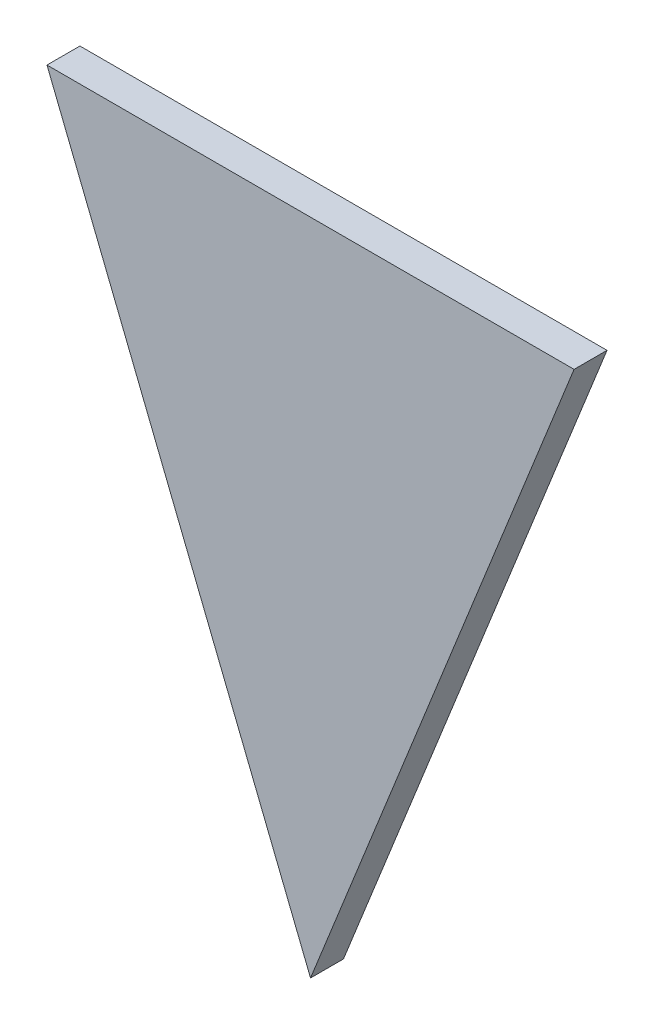
ISO-10303-21;
HEADER;
FILE_DESCRIPTION(('STEP AP214'),'2;1');
FILE_NAME('part.step','',(''),(''),'','','');
FILE_SCHEMA(('AUTOMOTIVE_DESIGN { 1 0 10303 214 1 1 1 1 }'));
ENDSEC;
DATA;
#1=APPLICATION_CONTEXT('core data for automotive mechanical design processes');
#2=APPLICATION_PROTOCOL_DEFINITION('international standard','automotive_design',2000,#1);
#3=PRODUCT_CONTEXT('',#1,'mechanical');
#4=PRODUCT('Part','Part','',(#3));
#5=PRODUCT_RELATED_PRODUCT_CATEGORY('part','',(#4));
#6=PRODUCT_DEFINITION_FORMATION('','',#4);
#7=PRODUCT_DEFINITION_CONTEXT('part definition',#1,'design');
#8=PRODUCT_DEFINITION('design','',#6,#7);
#9=PRODUCT_DEFINITION_SHAPE('','',#8);
#10=(LENGTH_UNIT() NAMED_UNIT(*) SI_UNIT(.MILLI.,.METRE.));
#11=(NAMED_UNIT(*) PLANE_ANGLE_UNIT() SI_UNIT($,.RADIAN.));
#12=(NAMED_UNIT(*) SI_UNIT($,.STERADIAN.) SOLID_ANGLE_UNIT());
#13=UNCERTAINTY_MEASURE_WITH_UNIT(LENGTH_MEASURE(1.E-05),#10,'distance_accuracy_value','');
#14=(GEOMETRIC_REPRESENTATION_CONTEXT(3) GLOBAL_UNCERTAINTY_ASSIGNED_CONTEXT((#13)) GLOBAL_UNIT_ASSIGNED_CONTEXT((#10,
#11,#12)) REPRESENTATION_CONTEXT('',''));
#15=CARTESIAN_POINT('',(0.,0.,0.));
#16=DIRECTION('',(0.,0.,1.));
#17=DIRECTION('',(1.,0.,0.));
#18=AXIS2_PLACEMENT_3D('',#15,#16,#17);
#19=CARTESIAN_POINT('',(0.,0.,0.));
#20=DIRECTION('',(0.,0.,1.));
#21=DIRECTION('',(1.,0.,0.));
#22=AXIS2_PLACEMENT_3D('',#19,#20,#21);
#23=PLANE('',#22);
#24=DIRECTION('',(-1.,0.,0.));
#25=VECTOR('',#24,1.);
#26=CARTESIAN_POINT('',(1.016,3.048,0.));
#27=LINE('',#26,#25);
#28=CARTESIAN_POINT('',(1.016,3.048,0.));
#29=VERTEX_POINT('',#28);
#30=CARTESIAN_POINT('',(-1.016,3.048,0.));
#31=VERTEX_POINT('',#30);
#32=EDGE_CURVE('E11',#29,#31,#27,.T.);
#33=ORIENTED_EDGE('',*,*,#32,.F.);
#34=DIRECTION('',(0.371390676354104,0.928476690885259,0.));
#35=VECTOR('',#34,1.);
#36=CARTESIAN_POINT('',(0.,0.508,0.));
#37=LINE('',#36,#35);
#38=CARTESIAN_POINT('',(0.,0.508,0.));
#39=VERTEX_POINT('',#38);
#40=EDGE_CURVE('E26',#39,#29,#37,.T.);
#41=ORIENTED_EDGE('',*,*,#40,.F.);
#42=DIRECTION('',(0.371390676354104,-0.928476690885259,0.));
#43=VECTOR('',#42,1.);
#44=CARTESIAN_POINT('',(-1.016,3.048,0.));
#45=LINE('',#44,#43);
#46=EDGE_CURVE('E91',#31,#39,#45,.T.);
#47=ORIENTED_EDGE('',*,*,#46,.F.);
#48=EDGE_LOOP('',(#33,#41,#47));
#49=FACE_BOUND('',#48,.T.);
#50=ADVANCED_FACE('F17',(#49),#23,.F.);
#51=CARTESIAN_POINT('',(-1.016,3.048,0.127));
#52=DIRECTION('',(0.928476690885259,0.371390676354104,0.));
#53=DIRECTION('',(-0.371390676354104,0.928476690885259,0.));
#54=AXIS2_PLACEMENT_3D('',#51,#52,#53);
#55=PLANE('',#54);
#56=ORIENTED_EDGE('',*,*,#46,.T.);
#57=DIRECTION('',(0.,0.,-1.));
#58=VECTOR('',#57,1.);
#59=CARTESIAN_POINT('',(0.,0.508,0.127));
#60=LINE('',#59,#58);
#61=CARTESIAN_POINT('',(0.,0.508,0.127));
#62=VERTEX_POINT('',#61);
#63=EDGE_CURVE('E86',#62,#39,#60,.T.);
#64=ORIENTED_EDGE('',*,*,#63,.F.);
#65=DIRECTION('',(0.371390676354104,-0.928476690885259,0.));
#66=VECTOR('',#65,1.);
#67=CARTESIAN_POINT('',(-1.016,3.048,0.127));
#68=LINE('',#67,#66);
#69=CARTESIAN_POINT('',(-1.016,3.048,0.127));
#70=VERTEX_POINT('',#69);
#71=EDGE_CURVE('E68',#70,#62,#68,.T.);
#72=ORIENTED_EDGE('',*,*,#71,.F.);
#73=DIRECTION('',(0.,0.,-1.));
#74=VECTOR('',#73,1.);
#75=CARTESIAN_POINT('',(-1.016,3.048,0.127));
#76=LINE('',#75,#74);
#77=EDGE_CURVE('E54',#70,#31,#76,.T.);
#78=ORIENTED_EDGE('',*,*,#77,.T.);
#79=EDGE_LOOP('',(#56,#64,#72,#78));
#80=FACE_BOUND('',#79,.T.);
#81=ADVANCED_FACE('F103',(#80),#55,.F.);
#82=CARTESIAN_POINT('',(1.016,3.048,0.127));
#83=DIRECTION('',(0.,-1.,0.));
#84=DIRECTION('',(0.,0.,-1.));
#85=AXIS2_PLACEMENT_3D('',#82,#83,#84);
#86=PLANE('',#85);
#87=ORIENTED_EDGE('',*,*,#32,.T.);
#88=ORIENTED_EDGE('',*,*,#77,.F.);
#89=DIRECTION('',(-1.,0.,0.));
#90=VECTOR('',#89,1.);
#91=CARTESIAN_POINT('',(1.016,3.048,0.127));
#92=LINE('',#91,#90);
#93=CARTESIAN_POINT('',(1.016,3.048,0.127));
#94=VERTEX_POINT('',#93);
#95=EDGE_CURVE('E49',#94,#70,#92,.T.);
#96=ORIENTED_EDGE('',*,*,#95,.F.);
#97=DIRECTION('',(0.,0.,-1.));
#98=VECTOR('',#97,1.);
#99=CARTESIAN_POINT('',(1.016,3.048,0.127));
#100=LINE('',#99,#98);
#101=EDGE_CURVE('E52',#94,#29,#100,.T.);
#102=ORIENTED_EDGE('',*,*,#101,.T.);
#103=EDGE_LOOP('',(#87,#88,#96,#102));
#104=FACE_BOUND('',#103,.T.);
#105=ADVANCED_FACE('F51',(#104),#86,.F.);
#106=CARTESIAN_POINT('',(0.,0.508,0.127));
#107=DIRECTION('',(-0.928476690885259,0.371390676354104,0.));
#108=DIRECTION('',(-0.371390676354104,-0.928476690885259,0.));
#109=AXIS2_PLACEMENT_3D('',#106,#107,#108);
#110=PLANE('',#109);
#111=ORIENTED_EDGE('',*,*,#40,.T.);
#112=ORIENTED_EDGE('',*,*,#101,.F.);
#113=DIRECTION('',(0.371390676354104,0.928476690885259,0.));
#114=VECTOR('',#113,1.);
#115=CARTESIAN_POINT('',(0.,0.508,0.127));
#116=LINE('',#115,#114);
#117=EDGE_CURVE('E64',#62,#94,#116,.T.);
#118=ORIENTED_EDGE('',*,*,#117,.F.);
#119=ORIENTED_EDGE('',*,*,#63,.T.);
#120=EDGE_LOOP('',(#111,#112,#118,#119));
#121=FACE_BOUND('',#120,.T.);
#122=ADVANCED_FACE('F62',(#121),#110,.F.);
#123=CARTESIAN_POINT('',(0.,0.,0.127));
#124=DIRECTION('',(0.,0.,1.));
#125=DIRECTION('',(1.,0.,0.));
#126=AXIS2_PLACEMENT_3D('',#123,#124,#125);
#127=PLANE('',#126);
#128=ORIENTED_EDGE('',*,*,#95,.T.);
#129=ORIENTED_EDGE('',*,*,#71,.T.);
#130=ORIENTED_EDGE('',*,*,#117,.T.);
#131=EDGE_LOOP('',(#128,#129,#130));
#132=FACE_BOUND('',#131,.T.);
#133=ADVANCED_FACE('F67',(#132),#127,.T.);
#134=CLOSED_SHELL('',(#50,#81,#105,#122,#133));
#135=MANIFOLD_SOLID_BREP('B1',#134);
#136=ADVANCED_BREP_SHAPE_REPRESENTATION('',(#18,#135),#14);
#137=SHAPE_DEFINITION_REPRESENTATION(#9,#136);
ENDSEC;
END-ISO-10303-21;
